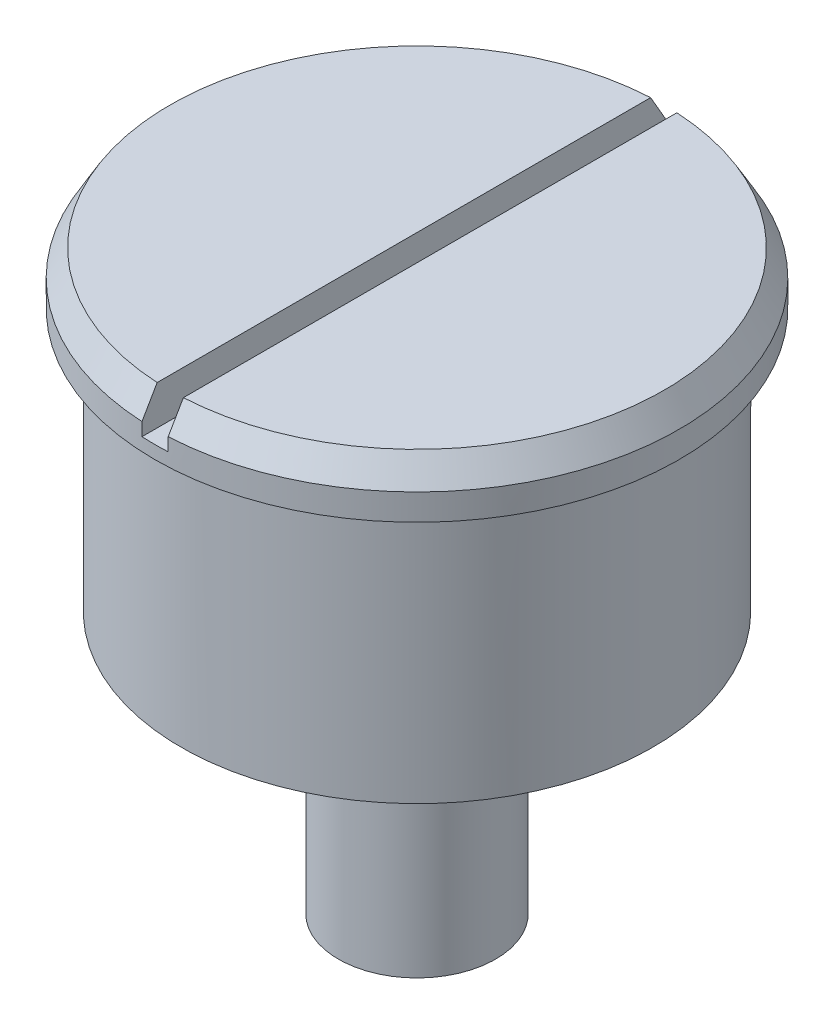
ISO-10303-21;
HEADER;
FILE_DESCRIPTION(('STEP AP214'),'2;1');
FILE_NAME('part.step','',(''),(''),'','','');
FILE_SCHEMA(('AUTOMOTIVE_DESIGN { 1 0 10303 214 1 1 1 1 }'));
ENDSEC;
DATA;
#1=APPLICATION_CONTEXT('core data for automotive mechanical design processes');
#2=APPLICATION_PROTOCOL_DEFINITION('international standard','automotive_design',2000,#1);
#3=PRODUCT_CONTEXT('',#1,'mechanical');
#4=PRODUCT('Part','Part','',(#3));
#5=PRODUCT_RELATED_PRODUCT_CATEGORY('part','',(#4));
#6=PRODUCT_DEFINITION_FORMATION('','',#4);
#7=PRODUCT_DEFINITION_CONTEXT('part definition',#1,'design');
#8=PRODUCT_DEFINITION('design','',#6,#7);
#9=PRODUCT_DEFINITION_SHAPE('','',#8);
#10=(LENGTH_UNIT() NAMED_UNIT(*) SI_UNIT(.MILLI.,.METRE.));
#11=(NAMED_UNIT(*) PLANE_ANGLE_UNIT() SI_UNIT($,.RADIAN.));
#12=(NAMED_UNIT(*) SI_UNIT($,.STERADIAN.) SOLID_ANGLE_UNIT());
#13=UNCERTAINTY_MEASURE_WITH_UNIT(LENGTH_MEASURE(1.E-05),#10,'distance_accuracy_value','');
#14=(GEOMETRIC_REPRESENTATION_CONTEXT(3) GLOBAL_UNCERTAINTY_ASSIGNED_CONTEXT((#13)) GLOBAL_UNIT_ASSIGNED_CONTEXT((#10,
#11,#12)) REPRESENTATION_CONTEXT('',''));
#15=CARTESIAN_POINT('',(0.,0.,0.));
#16=DIRECTION('',(0.,0.,1.));
#17=DIRECTION('',(1.,0.,0.));
#18=AXIS2_PLACEMENT_3D('',#15,#16,#17);
#19=CARTESIAN_POINT('',(0.,5.,0.));
#20=DIRECTION('',(0.,1.,0.));
#21=DIRECTION('',(0.,0.,1.));
#22=AXIS2_PLACEMENT_3D('',#19,#20,#21);
#23=PLANE('',#22);
#24=DIRECTION('',(0.,0.,1.));
#25=VECTOR('',#24,1.);
#26=CARTESIAN_POINT('',(-0.25,5.,0.));
#27=LINE('',#26,#25);
#28=CARTESIAN_POINT('',(-0.25,5.,-4.70468723587288));
#29=VERTEX_POINT('',#28);
#30=CARTESIAN_POINT('',(-0.25,5.,4.70468723587288));
#31=VERTEX_POINT('',#30);
#32=EDGE_CURVE('E153',#29,#31,#27,.T.);
#33=ORIENTED_EDGE('',*,*,#32,.F.);
#34=CARTESIAN_POINT('',(0.,5.,0.));
#35=DIRECTION('',(0.,1.,0.));
#36=DIRECTION('',(0.,0.,1.));
#37=AXIS2_PLACEMENT_3D('',#34,#35,#36);
#38=CIRCLE('',#37,4.71132486540519);
#39=EDGE_CURVE('E301',#29,#31,#38,.T.);
#40=ORIENTED_EDGE('',*,*,#39,.T.);
#41=EDGE_LOOP('',(#33,#40));
#42=FACE_BOUND('',#41,.T.);
#43=ADVANCED_FACE('F48',(#42),#23,.T.);
#44=CARTESIAN_POINT('',(0.,4.,0.));
#45=DIRECTION('',(0.,-1.,0.));
#46=DIRECTION('',(0.,0.,-1.));
#47=AXIS2_PLACEMENT_3D('',#44,#45,#46);
#48=CYLINDRICAL_SURFACE('',#47,4.5);
#49=CARTESIAN_POINT('',(0.,4.,0.));
#50=DIRECTION('',(0.,1.,0.));
#51=DIRECTION('',(0.,0.,1.));
#52=AXIS2_PLACEMENT_3D('',#49,#50,#51);
#53=CIRCLE('',#52,4.5);
#54=CARTESIAN_POINT('',(0.,4.,4.5));
#55=VERTEX_POINT('',#54);
#56=EDGE_CURVE('E148',#55,#55,#53,.T.);
#57=ORIENTED_EDGE('',*,*,#56,.F.);
#58=EDGE_LOOP('',(#57));
#59=FACE_BOUND('',#58,.T.);
#60=CARTESIAN_POINT('',(0.,-1.,0.));
#61=DIRECTION('',(0.,-1.,0.));
#62=DIRECTION('',(0.,0.,-1.));
#63=AXIS2_PLACEMENT_3D('',#60,#61,#62);
#64=CIRCLE('',#63,4.5);
#65=CARTESIAN_POINT('',(0.,-1.,-4.5));
#66=VERTEX_POINT('',#65);
#67=EDGE_CURVE('E133',#66,#66,#64,.T.);
#68=ORIENTED_EDGE('',*,*,#67,.F.);
#69=EDGE_LOOP('',(#68));
#70=FACE_BOUND('',#69,.T.);
#71=ADVANCED_FACE('F188',(#59,#70),#48,.T.);
#72=CARTESIAN_POINT('',(0.,5.,0.));
#73=DIRECTION('',(0.,-1.,0.));
#74=DIRECTION('',(0.,0.,-1.));
#75=AXIS2_PLACEMENT_3D('',#72,#73,#74);
#76=CYLINDRICAL_SURFACE('',#75,5.);
#77=DIRECTION('',(0.,-1.,0.));
#78=VECTOR('',#77,1.);
#79=CARTESIAN_POINT('',(0.250000000000002,5.,-4.99374608885955));
#80=LINE('',#79,#78);
#81=CARTESIAN_POINT('',(0.250000000000002,4.25,-4.99374608885955));
#82=VERTEX_POINT('',#81);
#83=CARTESIAN_POINT('',(0.250000000000002,4.49999999999999,-4.99374608885955));
#84=VERTEX_POINT('',#83);
#85=EDGE_CURVE('E110',#82,#84,#80,.F.);
#86=ORIENTED_EDGE('',*,*,#85,.T.);
#87=CARTESIAN_POINT('',(0.,4.49999999999999,0.));
#88=DIRECTION('',(0.,1.,0.));
#89=DIRECTION('',(0.,0.,1.));
#90=AXIS2_PLACEMENT_3D('',#87,#88,#89);
#91=CIRCLE('',#90,5.);
#92=CARTESIAN_POINT('',(0.250000000000002,4.49999999999999,4.99374608885955));
#93=VERTEX_POINT('',#92);
#94=EDGE_CURVE('E302',#84,#93,#91,.F.);
#95=ORIENTED_EDGE('',*,*,#94,.T.);
#96=DIRECTION('',(0.,-1.,0.));
#97=VECTOR('',#96,1.);
#98=CARTESIAN_POINT('',(0.250000000000002,5.,4.99374608885955));
#99=LINE('',#98,#97);
#100=CARTESIAN_POINT('',(0.250000000000002,4.25,4.99374608885955));
#101=VERTEX_POINT('',#100);
#102=EDGE_CURVE('E127',#93,#101,#99,.T.);
#103=ORIENTED_EDGE('',*,*,#102,.T.);
#104=CARTESIAN_POINT('',(0.,4.25,0.));
#105=DIRECTION('',(0.,-1.,0.));
#106=DIRECTION('',(0.,0.,-1.));
#107=AXIS2_PLACEMENT_3D('',#104,#105,#106);
#108=CIRCLE('',#107,5.);
#109=CARTESIAN_POINT('',(-0.25,4.25,4.99374608885955));
#110=VERTEX_POINT('',#109);
#111=EDGE_CURVE('E118',#101,#110,#108,.T.);
#112=ORIENTED_EDGE('',*,*,#111,.T.);
#113=DIRECTION('',(0.,-1.,0.));
#114=VECTOR('',#113,1.);
#115=CARTESIAN_POINT('',(-0.25,5.,4.99374608885955));
#116=LINE('',#115,#114);
#117=CARTESIAN_POINT('',(-0.25,4.49999999999999,4.99374608885955));
#118=VERTEX_POINT('',#117);
#119=EDGE_CURVE('E141',#110,#118,#116,.F.);
#120=ORIENTED_EDGE('',*,*,#119,.T.);
#121=CARTESIAN_POINT('',(0.,4.49999999999999,0.));
#122=DIRECTION('',(0.,1.,0.));
#123=DIRECTION('',(0.,0.,1.));
#124=AXIS2_PLACEMENT_3D('',#121,#122,#123);
#125=CIRCLE('',#124,5.);
#126=CARTESIAN_POINT('',(-0.25,4.49999999999999,-4.99374608885955));
#127=VERTEX_POINT('',#126);
#128=EDGE_CURVE('E304',#118,#127,#125,.F.);
#129=ORIENTED_EDGE('',*,*,#128,.T.);
#130=DIRECTION('',(0.,-1.,0.));
#131=VECTOR('',#130,1.);
#132=CARTESIAN_POINT('',(-0.25,5.,-4.99374608885955));
#133=LINE('',#132,#131);
#134=CARTESIAN_POINT('',(-0.25,4.25,-4.99374608885955));
#135=VERTEX_POINT('',#134);
#136=EDGE_CURVE('E112',#127,#135,#133,.T.);
#137=ORIENTED_EDGE('',*,*,#136,.T.);
#138=EDGE_CURVE('E106',#135,#82,#108,.T.);
#139=ORIENTED_EDGE('',*,*,#138,.T.);
#140=EDGE_LOOP('',(#86,#95,#103,#112,#120,#129,#137,#139));
#141=FACE_BOUND('',#140,.T.);
#142=CARTESIAN_POINT('',(0.,4.,0.));
#143=DIRECTION('',(0.,1.,0.));
#144=DIRECTION('',(0.,0.,1.));
#145=AXIS2_PLACEMENT_3D('',#142,#143,#144);
#146=CIRCLE('',#145,5.);
#147=CARTESIAN_POINT('',(0.,4.,5.));
#148=VERTEX_POINT('',#147);
#149=EDGE_CURVE('E145',#148,#148,#146,.T.);
#150=ORIENTED_EDGE('',*,*,#149,.T.);
#151=EDGE_LOOP('',(#150));
#152=FACE_BOUND('',#151,.T.);
#153=ADVANCED_FACE('F108',(#141,#152),#76,.T.);
#154=DIRECTION('',(0.,0.,-1.));
#155=VECTOR('',#154,1.);
#156=CARTESIAN_POINT('',(0.250000000000002,5.,0.));
#157=LINE('',#156,#155);
#158=CARTESIAN_POINT('',(0.250000000000002,5.,4.70468723587288));
#159=VERTEX_POINT('',#158);
#160=CARTESIAN_POINT('',(0.250000000000002,5.,-4.70468723587288));
#161=VERTEX_POINT('',#160);
#162=EDGE_CURVE('E151',#159,#161,#157,.T.);
#163=ORIENTED_EDGE('',*,*,#162,.F.);
#164=CARTESIAN_POINT('',(0.,5.,0.));
#165=DIRECTION('',(0.,1.,0.));
#166=DIRECTION('',(0.,0.,1.));
#167=AXIS2_PLACEMENT_3D('',#164,#165,#166);
#168=CIRCLE('',#167,4.71132486540519);
#169=EDGE_CURVE('E117',#159,#161,#168,.T.);
#170=ORIENTED_EDGE('',*,*,#169,.T.);
#171=EDGE_LOOP('',(#163,#170));
#172=FACE_BOUND('',#171,.T.);
#173=ADVANCED_FACE('F180',(#172),#23,.T.);
#174=CARTESIAN_POINT('',(0.,4.,0.));
#175=DIRECTION('',(0.,1.,0.));
#176=DIRECTION('',(0.,0.,1.));
#177=AXIS2_PLACEMENT_3D('',#174,#175,#176);
#178=PLANE('',#177);
#179=ORIENTED_EDGE('',*,*,#56,.T.);
#180=EDGE_LOOP('',(#179));
#181=FACE_BOUND('',#180,.T.);
#182=ORIENTED_EDGE('',*,*,#149,.F.);
#183=EDGE_LOOP('',(#182));
#184=FACE_BOUND('',#183,.T.);
#185=ADVANCED_FACE('F179',(#181,#184),#178,.F.);
#186=CARTESIAN_POINT('',(0.250000000000002,4.25,-5.));
#187=DIRECTION('',(0.,-1.,0.));
#188=DIRECTION('',(0.,0.,-1.));
#189=AXIS2_PLACEMENT_3D('',#186,#187,#188);
#190=PLANE('',#189);
#191=DIRECTION('',(0.,0.,1.));
#192=VECTOR('',#191,1.);
#193=CARTESIAN_POINT('',(0.250000000000002,4.25,-5.));
#194=LINE('',#193,#192);
#195=EDGE_CURVE('E125',#82,#101,#194,.T.);
#196=ORIENTED_EDGE('',*,*,#195,.F.);
#197=ORIENTED_EDGE('',*,*,#138,.F.);
#198=DIRECTION('',(0.,0.,1.));
#199=VECTOR('',#198,1.);
#200=CARTESIAN_POINT('',(-0.25,4.25,-5.));
#201=LINE('',#200,#199);
#202=EDGE_CURVE('E128',#135,#110,#201,.T.);
#203=ORIENTED_EDGE('',*,*,#202,.T.);
#204=ORIENTED_EDGE('',*,*,#111,.F.);
#205=EDGE_LOOP('',(#196,#197,#203,#204));
#206=FACE_BOUND('',#205,.T.);
#207=ADVANCED_FACE('F131',(#206),#190,.F.);
#208=CARTESIAN_POINT('',(-0.25,4.25,-5.));
#209=DIRECTION('',(-1.,0.,0.));
#210=DIRECTION('',(0.,0.,1.));
#211=AXIS2_PLACEMENT_3D('',#208,#209,#210);
#212=PLANE('',#211);
#213=ORIENTED_EDGE('',*,*,#32,.T.);
#214=CARTESIAN_POINT('',(-0.25,5.,4.70468723587288));
#215=CARTESIAN_POINT('',(-0.25,4.91666831739717,4.75286656672599));
#216=CARTESIAN_POINT('',(-0.25,4.83333580942873,4.80104446990165));
#217=CARTESIAN_POINT('',(-0.25,4.66666914276206,4.8973974208972));
#218=CARTESIAN_POINT('',(-0.25,4.58333498406383,4.9455724687171));
#219=CARTESIAN_POINT('',(-0.25,4.49999999999999,4.99374608885955));
#220=B_SPLINE_CURVE_WITH_KNOTS('',3,(#214,#215,#216,#217,#218,#219),.UNSPECIFIED.,.F.,.F.,(4,2,
4),(0.,0.288771112039316,0.577542224073595),.UNSPECIFIED.);
#221=EDGE_CURVE('E13',#31,#118,#220,.T.);
#222=ORIENTED_EDGE('',*,*,#221,.T.);
#223=ORIENTED_EDGE('',*,*,#119,.F.);
#224=ORIENTED_EDGE('',*,*,#202,.F.);
#225=ORIENTED_EDGE('',*,*,#136,.F.);
#226=CARTESIAN_POINT('',(-0.25,4.49999999999999,-4.99374608885955));
#227=CARTESIAN_POINT('',(-0.25,4.58333498406383,-4.9455724687171));
#228=CARTESIAN_POINT('',(-0.25,4.66666914276206,-4.8973974208972));
#229=CARTESIAN_POINT('',(-0.25,4.83333580942873,-4.80104446990165));
#230=CARTESIAN_POINT('',(-0.25,4.91666831739717,-4.75286656672599));
#231=CARTESIAN_POINT('',(-0.25,5.,-4.70468723587288));
#232=B_SPLINE_CURVE_WITH_KNOTS('',3,(#226,#227,#228,#229,#230,#231),.UNSPECIFIED.,.F.,.F.,(4,2,
4),(0.,0.288771112034278,0.577542224073595),.UNSPECIFIED.);
#233=EDGE_CURVE('E61',#127,#29,#232,.T.);
#234=ORIENTED_EDGE('',*,*,#233,.T.);
#235=EDGE_LOOP('',(#213,#222,#223,#224,#225,#234));
#236=FACE_BOUND('',#235,.T.);
#237=ADVANCED_FACE('F173',(#236),#212,.F.);
#238=CARTESIAN_POINT('',(0.250000000000001,8.41791592457923,-5.));
#239=DIRECTION('',(1.,0.,0.));
#240=DIRECTION('',(0.,1.,0.));
#241=AXIS2_PLACEMENT_3D('',#238,#239,#240);
#242=PLANE('',#241);
#243=ORIENTED_EDGE('',*,*,#162,.T.);
#244=CARTESIAN_POINT('',(0.250000000000002,5.,-4.70468723587288));
#245=CARTESIAN_POINT('',(0.250000000000002,4.91666831739717,-4.75286656672599));
#246=CARTESIAN_POINT('',(0.250000000000002,4.83333580942873,-4.80104446990165));
#247=CARTESIAN_POINT('',(0.250000000000002,4.66666914276206,-4.8973974208972));
#248=CARTESIAN_POINT('',(0.250000000000002,4.58333498406383,-4.9455724687171));
#249=CARTESIAN_POINT('',(0.250000000000002,4.49999999999999,-4.99374608885955));
#250=B_SPLINE_CURVE_WITH_KNOTS('',3,(#244,#245,#246,#247,#248,#249),.UNSPECIFIED.,.F.,.F.,(4,2,
4),(0.,0.288771112039316,0.577542224073595),.UNSPECIFIED.);
#251=EDGE_CURVE('E126',#161,#84,#250,.T.);
#252=ORIENTED_EDGE('',*,*,#251,.T.);
#253=ORIENTED_EDGE('',*,*,#85,.F.);
#254=ORIENTED_EDGE('',*,*,#195,.T.);
#255=ORIENTED_EDGE('',*,*,#102,.F.);
#256=CARTESIAN_POINT('',(0.250000000000002,4.49999999999999,4.99374608885955));
#257=CARTESIAN_POINT('',(0.250000000000002,4.58333498406383,4.9455724687171));
#258=CARTESIAN_POINT('',(0.250000000000002,4.66666914276206,4.8973974208972));
#259=CARTESIAN_POINT('',(0.250000000000002,4.83333580942873,4.80104446990165));
#260=CARTESIAN_POINT('',(0.250000000000002,4.91666831739717,4.75286656672599));
#261=CARTESIAN_POINT('',(0.250000000000002,5.,4.70468723587288));
#262=B_SPLINE_CURVE_WITH_KNOTS('',3,(#256,#257,#258,#259,#260,#261),.UNSPECIFIED.,.F.,.F.,(4,2,
4),(0.,0.288771112034278,0.577542224073595),.UNSPECIFIED.);
#263=EDGE_CURVE('E157',#93,#159,#262,.T.);
#264=ORIENTED_EDGE('',*,*,#263,.T.);
#265=EDGE_LOOP('',(#243,#252,#253,#254,#255,#264));
#266=FACE_BOUND('',#265,.T.);
#267=ADVANCED_FACE('F123',(#266),#242,.F.);
#268=CARTESIAN_POINT('',(0.,5.,0.));
#269=DIRECTION('',(0.,-1.,0.));
#270=DIRECTION('',(0.,0.,-1.));
#271=AXIS2_PLACEMENT_3D('',#268,#269,#270);
#272=CONICAL_SURFACE('',#271,4.71132486540519,0.523598775598296);
#273=ORIENTED_EDGE('',*,*,#263,.F.);
#274=ORIENTED_EDGE('',*,*,#94,.F.);
#275=ORIENTED_EDGE('',*,*,#251,.F.);
#276=ORIENTED_EDGE('',*,*,#169,.F.);
#277=EDGE_LOOP('',(#273,#274,#275,#276));
#278=FACE_BOUND('',#277,.T.);
#279=ADVANCED_FACE('F167',(#278),#272,.T.);
#280=CARTESIAN_POINT('',(0.,5.,0.));
#281=DIRECTION('',(0.,-1.,0.));
#282=DIRECTION('',(0.,0.,-1.));
#283=AXIS2_PLACEMENT_3D('',#280,#281,#282);
#284=CONICAL_SURFACE('',#283,4.71132486540519,0.523598775598296);
#285=ORIENTED_EDGE('',*,*,#233,.F.);
#286=ORIENTED_EDGE('',*,*,#128,.F.);
#287=ORIENTED_EDGE('',*,*,#221,.F.);
#288=ORIENTED_EDGE('',*,*,#39,.F.);
#289=EDGE_LOOP('',(#285,#286,#287,#288));
#290=FACE_BOUND('',#289,.T.);
#291=ADVANCED_FACE('F50',(#290),#284,.T.);
#292=CARTESIAN_POINT('',(0.,-1.,0.));
#293=DIRECTION('',(0.,-1.,0.));
#294=DIRECTION('',(0.,0.,-1.));
#295=AXIS2_PLACEMENT_3D('',#292,#293,#294);
#296=PLANE('',#295);
#297=CARTESIAN_POINT('',(0.,-1.,0.));
#298=DIRECTION('',(0.,-1.,0.));
#299=DIRECTION('',(0.,0.,-1.));
#300=AXIS2_PLACEMENT_3D('',#297,#298,#299);
#301=CIRCLE('',#300,1.5);
#302=CARTESIAN_POINT('',(0.,-1.,-1.5));
#303=VERTEX_POINT('',#302);
#304=EDGE_CURVE('E218',#303,#303,#301,.T.);
#305=ORIENTED_EDGE('',*,*,#304,.F.);
#306=EDGE_LOOP('',(#305));
#307=FACE_BOUND('',#306,.T.);
#308=ORIENTED_EDGE('',*,*,#67,.T.);
#309=EDGE_LOOP('',(#308));
#310=FACE_BOUND('',#309,.T.);
#311=ADVANCED_FACE('F199',(#307,#310),#296,.T.);
#312=CARTESIAN_POINT('',(0.,-6.,0.));
#313=DIRECTION('',(0.,1.,0.));
#314=DIRECTION('',(0.,0.,1.));
#315=AXIS2_PLACEMENT_3D('',#312,#313,#314);
#316=CYLINDRICAL_SURFACE('',#315,1.5);
#317=CARTESIAN_POINT('',(0.,-6.,0.));
#318=DIRECTION('',(0.,-1.,0.));
#319=DIRECTION('',(0.,0.,-1.));
#320=AXIS2_PLACEMENT_3D('',#317,#318,#319);
#321=CIRCLE('',#320,1.5);
#322=CARTESIAN_POINT('',(0.,-6.,-1.5));
#323=VERTEX_POINT('',#322);
#324=EDGE_CURVE('E137',#323,#323,#321,.T.);
#325=ORIENTED_EDGE('',*,*,#324,.F.);
#326=EDGE_LOOP('',(#325));
#327=FACE_BOUND('',#326,.T.);
#328=ORIENTED_EDGE('',*,*,#304,.T.);
#329=EDGE_LOOP('',(#328));
#330=FACE_BOUND('',#329,.T.);
#331=ADVANCED_FACE('F201',(#327,#330),#316,.T.);
#332=CARTESIAN_POINT('',(0.,-6.,0.));
#333=DIRECTION('',(0.,-1.,0.));
#334=DIRECTION('',(0.,0.,-1.));
#335=AXIS2_PLACEMENT_3D('',#332,#333,#334);
#336=PLANE('',#335);
#337=ORIENTED_EDGE('',*,*,#324,.T.);
#338=EDGE_LOOP('',(#337));
#339=FACE_BOUND('',#338,.T.);
#340=ADVANCED_FACE('F207',(#339),#336,.T.);
#341=CLOSED_SHELL('',(#43,#71,#153,#173,#185,#207,#237,#267,#279,#291,#311,#331,#340));
#342=MANIFOLD_SOLID_BREP('B2',#341);
#343=ADVANCED_BREP_SHAPE_REPRESENTATION('',(#18,#342),#14);
#344=SHAPE_DEFINITION_REPRESENTATION(#9,#343);
ENDSEC;
END-ISO-10303-21;
